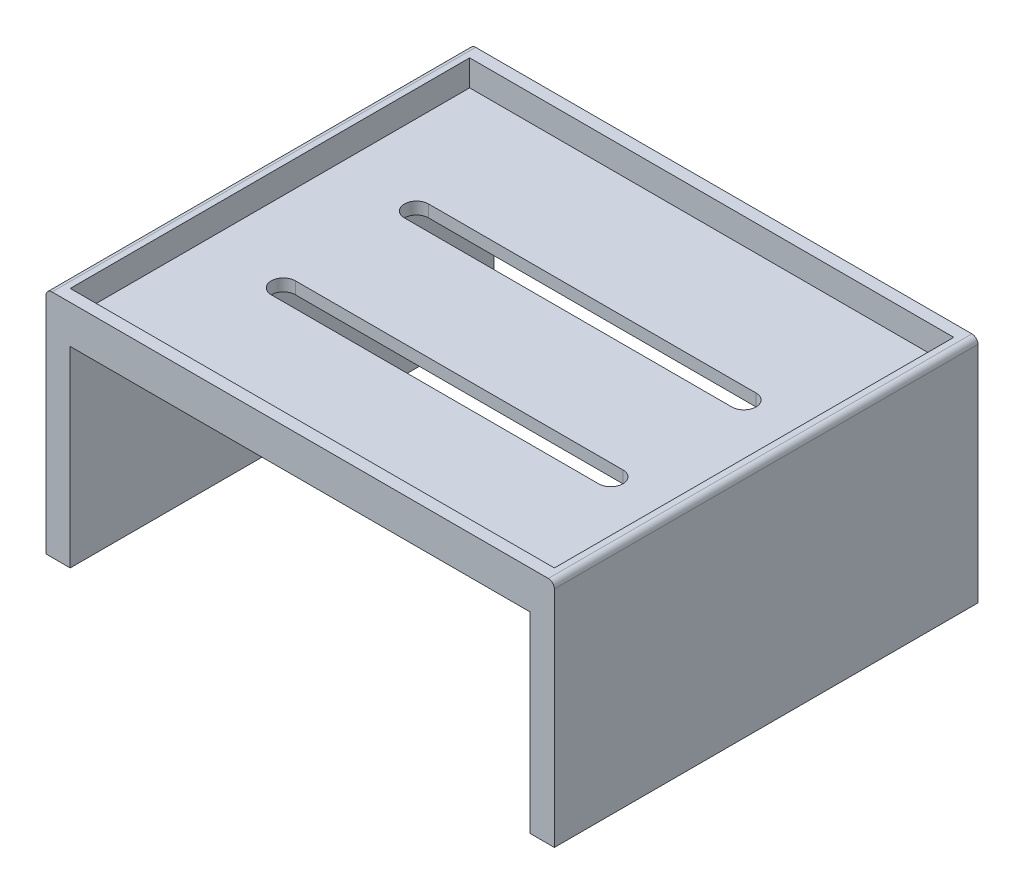
ISO-10303-21;
HEADER;
FILE_DESCRIPTION(('STEP AP214'),'2;1');
FILE_NAME('part.step','',(''),(''),'','','');
FILE_SCHEMA(('AUTOMOTIVE_DESIGN { 1 0 10303 214 1 1 1 1 }'));
ENDSEC;
DATA;
#1=APPLICATION_CONTEXT('core data for automotive mechanical design processes');
#2=APPLICATION_PROTOCOL_DEFINITION('international standard','automotive_design',2000,#1);
#3=PRODUCT_CONTEXT('',#1,'mechanical');
#4=PRODUCT('Part','Part','',(#3));
#5=PRODUCT_RELATED_PRODUCT_CATEGORY('part','',(#4));
#6=PRODUCT_DEFINITION_FORMATION('','',#4);
#7=PRODUCT_DEFINITION_CONTEXT('part definition',#1,'design');
#8=PRODUCT_DEFINITION('design','',#6,#7);
#9=PRODUCT_DEFINITION_SHAPE('','',#8);
#10=(LENGTH_UNIT() NAMED_UNIT(*) SI_UNIT(.MILLI.,.METRE.));
#11=(NAMED_UNIT(*) PLANE_ANGLE_UNIT() SI_UNIT($,.RADIAN.));
#12=(NAMED_UNIT(*) SI_UNIT($,.STERADIAN.) SOLID_ANGLE_UNIT());
#13=UNCERTAINTY_MEASURE_WITH_UNIT(LENGTH_MEASURE(1.E-05),#10,'distance_accuracy_value','');
#14=(GEOMETRIC_REPRESENTATION_CONTEXT(3) GLOBAL_UNCERTAINTY_ASSIGNED_CONTEXT((#13)) GLOBAL_UNIT_ASSIGNED_CONTEXT((#10,
#11,#12)) REPRESENTATION_CONTEXT('',''));
#15=CARTESIAN_POINT('',(0.,0.,0.));
#16=DIRECTION('',(0.,0.,1.));
#17=DIRECTION('',(1.,0.,0.));
#18=AXIS2_PLACEMENT_3D('',#15,#16,#17);
#19=CARTESIAN_POINT('',(-76.0997442455243,110.652173913043,-350.));
#20=DIRECTION('',(0.,1.,0.));
#21=DIRECTION('',(0.,0.,1.));
#22=AXIS2_PLACEMENT_3D('',#19,#20,#21);
#23=PLANE('',#22);
#24=DIRECTION('',(-1.,0.,0.));
#25=VECTOR('',#24,1.);
#26=CARTESIAN_POINT('',(-76.0997442455243,110.652173913043,-350.));
#27=LINE('',#26,#25);
#28=CARTESIAN_POINT('',(338.900255754476,110.652173913043,-350.));
#29=VERTEX_POINT('',#28);
#30=CARTESIAN_POINT('',(-71.0997442455243,110.652173913043,-350.));
#31=VERTEX_POINT('',#30);
#32=EDGE_CURVE('E307',#29,#31,#27,.T.);
#33=ORIENTED_EDGE('',*,*,#32,.T.);
#34=DIRECTION('',(0.,0.,1.));
#35=VECTOR('',#34,1.);
#36=CARTESIAN_POINT('',(-71.0997442455243,110.652173913043,-350.));
#37=LINE('',#36,#35);
#38=CARTESIAN_POINT('',(-71.0997442455243,110.652173913043,0.));
#39=VERTEX_POINT('',#38);
#40=EDGE_CURVE('E346',#31,#39,#37,.T.);
#41=ORIENTED_EDGE('',*,*,#40,.T.);
#42=DIRECTION('',(-1.,0.,0.));
#43=VECTOR('',#42,1.);
#44=CARTESIAN_POINT('',(-76.0997442455243,110.652173913043,0.));
#45=LINE('',#44,#43);
#46=CARTESIAN_POINT('',(338.900255754476,110.652173913043,0.));
#47=VERTEX_POINT('',#46);
#48=EDGE_CURVE('E289',#47,#39,#45,.T.);
#49=ORIENTED_EDGE('',*,*,#48,.F.);
#50=DIRECTION('',(0.,0.,1.));
#51=VECTOR('',#50,1.);
#52=CARTESIAN_POINT('',(338.900255754476,110.652173913043,-350.));
#53=LINE('',#52,#51);
#54=EDGE_CURVE('E334',#47,#29,#53,.F.);
#55=ORIENTED_EDGE('',*,*,#54,.T.);
#56=EDGE_LOOP('',(#33,#41,#49,#55));
#57=FACE_BOUND('',#56,.T.);
#58=DIRECTION('',(1.,0.,0.));
#59=VECTOR('',#58,1.);
#60=CARTESIAN_POINT('',(0.,110.652173913043,-340.));
#61=LINE('',#60,#59);
#62=CARTESIAN_POINT('',(-66.0997442455243,110.652173913043,-340.));
#63=VERTEX_POINT('',#62);
#64=CARTESIAN_POINT('',(333.900255754476,110.652173913043,-340.));
#65=VERTEX_POINT('',#64);
#66=EDGE_CURVE('E269',#63,#65,#61,.T.);
#67=ORIENTED_EDGE('',*,*,#66,.T.);
#68=DIRECTION('',(0.,0.,1.));
#69=VECTOR('',#68,1.);
#70=CARTESIAN_POINT('',(333.900255754476,110.652173913043,-1.68501705394022E-13));
#71=LINE('',#70,#69);
#72=CARTESIAN_POINT('',(333.900255754476,110.652173913043,-9.99999999999995));
#73=VERTEX_POINT('',#72);
#74=EDGE_CURVE('E222',#65,#73,#71,.T.);
#75=ORIENTED_EDGE('',*,*,#74,.T.);
#76=DIRECTION('',(1.,0.,0.));
#77=VECTOR('',#76,1.);
#78=CARTESIAN_POINT('',(0.,110.652173913043,-9.99999999999997));
#79=LINE('',#78,#77);
#80=CARTESIAN_POINT('',(-66.0997442455243,110.652173913043,-9.99999999999997));
#81=VERTEX_POINT('',#80);
#82=EDGE_CURVE('E258',#81,#73,#79,.T.);
#83=ORIENTED_EDGE('',*,*,#82,.F.);
#84=DIRECTION('',(0.,0.,1.));
#85=VECTOR('',#84,1.);
#86=CARTESIAN_POINT('',(-66.0997442455243,110.652173913043,0.));
#87=LINE('',#86,#85);
#88=EDGE_CURVE('E272',#63,#81,#87,.T.);
#89=ORIENTED_EDGE('',*,*,#88,.F.);
#90=EDGE_LOOP('',(#67,#75,#83,#89));
#91=FACE_BOUND('',#90,.T.);
#92=ADVANCED_FACE('F35',(#57,#91),#23,.T.);
#93=CARTESIAN_POINT('',(-76.0997442455243,110.652173913043,-350.));
#94=DIRECTION('',(-1.,0.,0.));
#95=DIRECTION('',(0.,-1.,0.));
#96=AXIS2_PLACEMENT_3D('',#93,#94,#95);
#97=PLANE('',#96);
#98=DIRECTION('',(0.,-1.,0.));
#99=VECTOR('',#98,1.);
#100=CARTESIAN_POINT('',(-76.0997442455243,110.652173913043,0.));
#101=LINE('',#100,#99);
#102=CARTESIAN_POINT('',(-76.0997442455243,105.652173913043,0.));
#103=VERTEX_POINT('',#102);
#104=CARTESIAN_POINT('',(-76.0997442455243,-79.3478260869565,0.));
#105=VERTEX_POINT('',#104);
#106=EDGE_CURVE('E279',#103,#105,#101,.T.);
#107=ORIENTED_EDGE('',*,*,#106,.F.);
#108=DIRECTION('',(0.,0.,1.));
#109=VECTOR('',#108,1.);
#110=CARTESIAN_POINT('',(-76.0997442455243,105.652173913043,-350.));
#111=LINE('',#110,#109);
#112=CARTESIAN_POINT('',(-76.0997442455243,105.652173913043,-350.));
#113=VERTEX_POINT('',#112);
#114=EDGE_CURVE('E353',#103,#113,#111,.F.);
#115=ORIENTED_EDGE('',*,*,#114,.T.);
#116=DIRECTION('',(0.,-1.,0.));
#117=VECTOR('',#116,1.);
#118=CARTESIAN_POINT('',(-76.0997442455243,110.652173913043,-350.));
#119=LINE('',#118,#117);
#120=CARTESIAN_POINT('',(-76.0997442455243,-79.3478260869565,-350.));
#121=VERTEX_POINT('',#120);
#122=EDGE_CURVE('E286',#113,#121,#119,.T.);
#123=ORIENTED_EDGE('',*,*,#122,.T.);
#124=DIRECTION('',(0.,0.,1.));
#125=VECTOR('',#124,1.);
#126=CARTESIAN_POINT('',(-76.0997442455243,-79.3478260869565,-350.));
#127=LINE('',#126,#125);
#128=EDGE_CURVE('E310',#121,#105,#127,.T.);
#129=ORIENTED_EDGE('',*,*,#128,.T.);
#130=EDGE_LOOP('',(#107,#115,#123,#129));
#131=FACE_BOUND('',#130,.T.);
#132=ADVANCED_FACE('F375',(#131),#97,.T.);
#133=CARTESIAN_POINT('',(343.900255754476,110.652173913043,-350.));
#134=DIRECTION('',(1.,0.,0.));
#135=DIRECTION('',(0.,1.,0.));
#136=AXIS2_PLACEMENT_3D('',#133,#134,#135);
#137=PLANE('',#136);
#138=DIRECTION('',(0.,1.,0.));
#139=VECTOR('',#138,1.);
#140=CARTESIAN_POINT('',(343.900255754476,110.652173913043,-350.));
#141=LINE('',#140,#139);
#142=CARTESIAN_POINT('',(343.900255754476,-79.3478260869565,-350.));
#143=VERTEX_POINT('',#142);
#144=CARTESIAN_POINT('',(343.900255754476,105.652173913043,-350.));
#145=VERTEX_POINT('',#144);
#146=EDGE_CURVE('E304',#143,#145,#141,.T.);
#147=ORIENTED_EDGE('',*,*,#146,.T.);
#148=DIRECTION('',(0.,0.,1.));
#149=VECTOR('',#148,1.);
#150=CARTESIAN_POINT('',(343.900255754476,105.652173913043,-350.));
#151=LINE('',#150,#149);
#152=CARTESIAN_POINT('',(343.900255754476,105.652173913043,0.));
#153=VERTEX_POINT('',#152);
#154=EDGE_CURVE('E11',#145,#153,#151,.T.);
#155=ORIENTED_EDGE('',*,*,#154,.T.);
#156=DIRECTION('',(0.,1.,0.));
#157=VECTOR('',#156,1.);
#158=CARTESIAN_POINT('',(343.900255754476,110.652173913043,0.));
#159=LINE('',#158,#157);
#160=CARTESIAN_POINT('',(343.900255754476,-79.3478260869565,0.));
#161=VERTEX_POINT('',#160);
#162=EDGE_CURVE('E327',#161,#153,#159,.T.);
#163=ORIENTED_EDGE('',*,*,#162,.F.);
#164=DIRECTION('',(0.,0.,1.));
#165=VECTOR('',#164,1.);
#166=CARTESIAN_POINT('',(343.900255754476,-79.3478260869565,-350.));
#167=LINE('',#166,#165);
#168=EDGE_CURVE('E332',#143,#161,#167,.T.);
#169=ORIENTED_EDGE('',*,*,#168,.F.);
#170=EDGE_LOOP('',(#147,#155,#163,#169));
#171=FACE_BOUND('',#170,.T.);
#172=ADVANCED_FACE('F398',(#171),#137,.T.);
#173=CARTESIAN_POINT('',(343.900255754476,-79.3478260869565,-350.));
#174=DIRECTION('',(0.,-1.,0.));
#175=DIRECTION('',(0.,0.,-1.));
#176=AXIS2_PLACEMENT_3D('',#173,#174,#175);
#177=PLANE('',#176);
#178=DIRECTION('',(1.,0.,0.));
#179=VECTOR('',#178,1.);
#180=CARTESIAN_POINT('',(343.900255754476,-79.3478260869565,0.));
#181=LINE('',#180,#179);
#182=CARTESIAN_POINT('',(323.900255754476,-79.3478260869565,0.));
#183=VERTEX_POINT('',#182);
#184=EDGE_CURVE('E324',#183,#161,#181,.T.);
#185=ORIENTED_EDGE('',*,*,#184,.F.);
#186=DIRECTION('',(0.,0.,1.));
#187=VECTOR('',#186,1.);
#188=CARTESIAN_POINT('',(323.900255754476,-79.3478260869565,-350.));
#189=LINE('',#188,#187);
#190=CARTESIAN_POINT('',(323.900255754476,-79.3478260869565,-350.));
#191=VERTEX_POINT('',#190);
#192=EDGE_CURVE('E335',#191,#183,#189,.T.);
#193=ORIENTED_EDGE('',*,*,#192,.F.);
#194=DIRECTION('',(1.,0.,0.));
#195=VECTOR('',#194,1.);
#196=CARTESIAN_POINT('',(343.900255754476,-79.3478260869565,-350.));
#197=LINE('',#196,#195);
#198=EDGE_CURVE('E301',#191,#143,#197,.T.);
#199=ORIENTED_EDGE('',*,*,#198,.T.);
#200=ORIENTED_EDGE('',*,*,#168,.T.);
#201=EDGE_LOOP('',(#185,#193,#199,#200));
#202=FACE_BOUND('',#201,.T.);
#203=ADVANCED_FACE('F394',(#202),#177,.T.);
#204=CARTESIAN_POINT('',(323.900255754476,-79.3478260869565,-350.));
#205=DIRECTION('',(-1.,0.,0.));
#206=DIRECTION('',(0.,-1.,0.));
#207=AXIS2_PLACEMENT_3D('',#204,#205,#206);
#208=PLANE('',#207);
#209=DIRECTION('',(0.,-1.,0.));
#210=VECTOR('',#209,1.);
#211=CARTESIAN_POINT('',(323.900255754476,-79.3478260869565,0.));
#212=LINE('',#211,#210);
#213=CARTESIAN_POINT('',(323.900255754476,79.1521739130436,0.));
#214=VERTEX_POINT('',#213);
#215=EDGE_CURVE('E321',#214,#183,#212,.T.);
#216=ORIENTED_EDGE('',*,*,#215,.F.);
#217=DIRECTION('',(0.,0.,1.));
#218=VECTOR('',#217,1.);
#219=CARTESIAN_POINT('',(323.900255754476,79.1521739130436,-350.));
#220=LINE('',#219,#218);
#221=CARTESIAN_POINT('',(323.900255754476,79.1521739130436,-350.));
#222=VERTEX_POINT('',#221);
#223=EDGE_CURVE('E337',#222,#214,#220,.T.);
#224=ORIENTED_EDGE('',*,*,#223,.F.);
#225=DIRECTION('',(0.,-1.,0.));
#226=VECTOR('',#225,1.);
#227=CARTESIAN_POINT('',(323.900255754476,-79.3478260869565,-350.));
#228=LINE('',#227,#226);
#229=EDGE_CURVE('E298',#222,#191,#228,.T.);
#230=ORIENTED_EDGE('',*,*,#229,.T.);
#231=ORIENTED_EDGE('',*,*,#192,.T.);
#232=EDGE_LOOP('',(#216,#224,#230,#231));
#233=FACE_BOUND('',#232,.T.);
#234=ADVANCED_FACE('F390',(#233),#208,.T.);
#235=CARTESIAN_POINT('',(323.900255754476,79.1521739130436,-350.));
#236=DIRECTION('',(0.,-1.,0.));
#237=DIRECTION('',(1.,0.,0.));
#238=AXIS2_PLACEMENT_3D('',#235,#236,#237);
#239=PLANE('',#238);
#240=CARTESIAN_POINT('',(0.,79.1521739130435,-230.));
#241=DIRECTION('',(0.,1.,0.));
#242=DIRECTION('',(0.,0.,1.));
#243=AXIS2_PLACEMENT_3D('',#240,#241,#242);
#244=CIRCLE('',#243,10.);
#245=CARTESIAN_POINT('',(0.,79.1521739130435,-240.));
#246=VERTEX_POINT('',#245);
#247=CARTESIAN_POINT('',(0.,79.1521739130435,-220.));
#248=VERTEX_POINT('',#247);
#249=EDGE_CURVE('E188',#246,#248,#244,.T.);
#250=ORIENTED_EDGE('',*,*,#249,.T.);
#251=DIRECTION('',(1.,0.,0.));
#252=VECTOR('',#251,1.);
#253=CARTESIAN_POINT('',(0.,79.1521739130435,-220.));
#254=LINE('',#253,#252);
#255=CARTESIAN_POINT('',(270.518831374512,79.1521739130435,-220.));
#256=VERTEX_POINT('',#255);
#257=EDGE_CURVE('E199',#248,#256,#254,.T.);
#258=ORIENTED_EDGE('',*,*,#257,.T.);
#259=CARTESIAN_POINT('',(270.518831374512,79.1521739130435,-230.));
#260=DIRECTION('',(0.,1.,0.));
#261=DIRECTION('',(0.,0.,1.));
#262=AXIS2_PLACEMENT_3D('',#259,#260,#261);
#263=CIRCLE('',#262,10.);
#264=CARTESIAN_POINT('',(270.518831374512,79.1521739130435,-240.));
#265=VERTEX_POINT('',#264);
#266=EDGE_CURVE('E50',#256,#265,#263,.T.);
#267=ORIENTED_EDGE('',*,*,#266,.T.);
#268=DIRECTION('',(-1.,0.,0.));
#269=VECTOR('',#268,1.);
#270=CARTESIAN_POINT('',(0.,79.1521739130435,-240.));
#271=LINE('',#270,#269);
#272=EDGE_CURVE('E196',#265,#246,#271,.T.);
#273=ORIENTED_EDGE('',*,*,#272,.T.);
#274=EDGE_LOOP('',(#250,#258,#267,#273));
#275=FACE_BOUND('',#274,.T.);
#276=CARTESIAN_POINT('',(270.518831374512,79.1521739130435,-120.));
#277=DIRECTION('',(0.,1.,0.));
#278=DIRECTION('',(0.,0.,1.));
#279=AXIS2_PLACEMENT_3D('',#276,#277,#278);
#280=CIRCLE('',#279,9.99999999999999);
#281=CARTESIAN_POINT('',(270.518831374512,79.1521739130435,-110.));
#282=VERTEX_POINT('',#281);
#283=CARTESIAN_POINT('',(270.518831374512,79.1521739130435,-130.));
#284=VERTEX_POINT('',#283);
#285=EDGE_CURVE('E226',#282,#284,#280,.T.);
#286=ORIENTED_EDGE('',*,*,#285,.T.);
#287=DIRECTION('',(-1.,0.,0.));
#288=VECTOR('',#287,1.);
#289=CARTESIAN_POINT('',(270.518831374512,79.1521739130435,-130.));
#290=LINE('',#289,#288);
#291=CARTESIAN_POINT('',(0.,79.1521739130435,-130.));
#292=VERTEX_POINT('',#291);
#293=EDGE_CURVE('E229',#284,#292,#290,.T.);
#294=ORIENTED_EDGE('',*,*,#293,.T.);
#295=CARTESIAN_POINT('',(0.,79.1521739130435,-120.));
#296=DIRECTION('',(0.,1.,0.));
#297=DIRECTION('',(0.,0.,1.));
#298=AXIS2_PLACEMENT_3D('',#295,#296,#297);
#299=CIRCLE('',#298,9.99999999999999);
#300=CARTESIAN_POINT('',(0.,79.1521739130435,-110.));
#301=VERTEX_POINT('',#300);
#302=EDGE_CURVE('E58',#292,#301,#299,.T.);
#303=ORIENTED_EDGE('',*,*,#302,.T.);
#304=DIRECTION('',(1.,0.,0.));
#305=VECTOR('',#304,1.);
#306=CARTESIAN_POINT('',(270.518831374512,79.1521739130435,-110.));
#307=LINE('',#306,#305);
#308=EDGE_CURVE('E234',#301,#282,#307,.T.);
#309=ORIENTED_EDGE('',*,*,#308,.T.);
#310=EDGE_LOOP('',(#286,#294,#303,#309));
#311=FACE_BOUND('',#310,.T.);
#312=DIRECTION('',(1.,0.,0.));
#313=VECTOR('',#312,1.);
#314=CARTESIAN_POINT('',(323.900255754476,79.1521739130436,0.));
#315=LINE('',#314,#313);
#316=CARTESIAN_POINT('',(-56.0997442455243,79.1521739130435,0.));
#317=VERTEX_POINT('',#316);
#318=EDGE_CURVE('E318',#317,#214,#315,.T.);
#319=ORIENTED_EDGE('',*,*,#318,.F.);
#320=DIRECTION('',(0.,0.,1.));
#321=VECTOR('',#320,1.);
#322=CARTESIAN_POINT('',(-56.0997442455243,79.1521739130435,-350.));
#323=LINE('',#322,#321);
#324=CARTESIAN_POINT('',(-56.0997442455243,79.1521739130435,-350.));
#325=VERTEX_POINT('',#324);
#326=EDGE_CURVE('E339',#325,#317,#323,.T.);
#327=ORIENTED_EDGE('',*,*,#326,.F.);
#328=DIRECTION('',(1.,0.,0.));
#329=VECTOR('',#328,1.);
#330=CARTESIAN_POINT('',(323.900255754476,79.1521739130436,-350.));
#331=LINE('',#330,#329);
#332=EDGE_CURVE('E295',#325,#222,#331,.T.);
#333=ORIENTED_EDGE('',*,*,#332,.T.);
#334=ORIENTED_EDGE('',*,*,#223,.T.);
#335=EDGE_LOOP('',(#319,#327,#333,#334));
#336=FACE_BOUND('',#335,.T.);
#337=ADVANCED_FACE('F203',(#275,#311,#336),#239,.T.);
#338=CARTESIAN_POINT('',(-56.0997442455243,-79.3478260869565,-350.));
#339=DIRECTION('',(1.,0.,0.));
#340=DIRECTION('',(0.,0.,-1.));
#341=AXIS2_PLACEMENT_3D('',#338,#339,#340);
#342=PLANE('',#341);
#343=DIRECTION('',(0.,1.,0.));
#344=VECTOR('',#343,1.);
#345=CARTESIAN_POINT('',(-56.0997442455243,-79.3478260869565,0.));
#346=LINE('',#345,#344);
#347=CARTESIAN_POINT('',(-56.0997442455243,-79.3478260869565,0.));
#348=VERTEX_POINT('',#347);
#349=EDGE_CURVE('E315',#348,#317,#346,.T.);
#350=ORIENTED_EDGE('',*,*,#349,.F.);
#351=DIRECTION('',(0.,0.,1.));
#352=VECTOR('',#351,1.);
#353=CARTESIAN_POINT('',(-56.0997442455243,-79.3478260869565,-350.));
#354=LINE('',#353,#352);
#355=CARTESIAN_POINT('',(-56.0997442455243,-79.3478260869565,-350.));
#356=VERTEX_POINT('',#355);
#357=EDGE_CURVE('E341',#356,#348,#354,.T.);
#358=ORIENTED_EDGE('',*,*,#357,.F.);
#359=DIRECTION('',(0.,1.,0.));
#360=VECTOR('',#359,1.);
#361=CARTESIAN_POINT('',(-56.0997442455243,-79.3478260869565,-350.));
#362=LINE('',#361,#360);
#363=EDGE_CURVE('E292',#356,#325,#362,.T.);
#364=ORIENTED_EDGE('',*,*,#363,.T.);
#365=ORIENTED_EDGE('',*,*,#326,.T.);
#366=EDGE_LOOP('',(#350,#358,#364,#365));
#367=FACE_BOUND('',#366,.T.);
#368=ADVANCED_FACE('F383',(#367),#342,.T.);
#369=CARTESIAN_POINT('',(-76.0997442455243,-79.3478260869565,-350.));
#370=DIRECTION('',(0.,-1.,0.));
#371=DIRECTION('',(0.,0.,-1.));
#372=AXIS2_PLACEMENT_3D('',#369,#370,#371);
#373=PLANE('',#372);
#374=DIRECTION('',(1.,0.,0.));
#375=VECTOR('',#374,1.);
#376=CARTESIAN_POINT('',(-76.0997442455243,-79.3478260869565,0.));
#377=LINE('',#376,#375);
#378=EDGE_CURVE('E312',#105,#348,#377,.T.);
#379=ORIENTED_EDGE('',*,*,#378,.F.);
#380=ORIENTED_EDGE('',*,*,#128,.F.);
#381=DIRECTION('',(1.,0.,0.));
#382=VECTOR('',#381,1.);
#383=CARTESIAN_POINT('',(-76.0997442455243,-79.3478260869565,-350.));
#384=LINE('',#383,#382);
#385=EDGE_CURVE('E288',#121,#356,#384,.T.);
#386=ORIENTED_EDGE('',*,*,#385,.T.);
#387=ORIENTED_EDGE('',*,*,#357,.T.);
#388=EDGE_LOOP('',(#379,#380,#386,#387));
#389=FACE_BOUND('',#388,.T.);
#390=ADVANCED_FACE('F379',(#389),#373,.T.);
#391=CARTESIAN_POINT('',(0.,0.,-350.));
#392=DIRECTION('',(0.,0.,1.));
#393=DIRECTION('',(1.,0.,0.));
#394=AXIS2_PLACEMENT_3D('',#391,#392,#393);
#395=PLANE('',#394);
#396=ORIENTED_EDGE('',*,*,#122,.F.);
#397=CARTESIAN_POINT('',(-71.0997442455243,105.652173913043,-350.));
#398=DIRECTION('',(0.,0.,1.));
#399=DIRECTION('',(1.,0.,0.));
#400=AXIS2_PLACEMENT_3D('',#397,#398,#399);
#401=CIRCLE('',#400,5.);
#402=EDGE_CURVE('E43',#113,#31,#401,.F.);
#403=ORIENTED_EDGE('',*,*,#402,.T.);
#404=ORIENTED_EDGE('',*,*,#32,.F.);
#405=CARTESIAN_POINT('',(338.900255754476,105.652173913043,-350.));
#406=DIRECTION('',(0.,0.,1.));
#407=DIRECTION('',(1.,0.,0.));
#408=AXIS2_PLACEMENT_3D('',#405,#406,#407);
#409=CIRCLE('',#408,5.);
#410=EDGE_CURVE('E355',#29,#145,#409,.F.);
#411=ORIENTED_EDGE('',*,*,#410,.T.);
#412=ORIENTED_EDGE('',*,*,#146,.F.);
#413=ORIENTED_EDGE('',*,*,#198,.F.);
#414=ORIENTED_EDGE('',*,*,#229,.F.);
#415=ORIENTED_EDGE('',*,*,#332,.F.);
#416=ORIENTED_EDGE('',*,*,#363,.F.);
#417=ORIENTED_EDGE('',*,*,#385,.F.);
#418=EDGE_LOOP('',(#396,#403,#404,#411,#412,#413,#414,#415,#416,#417));
#419=FACE_BOUND('',#418,.T.);
#420=ADVANCED_FACE('F360',(#419),#395,.F.);
#421=CARTESIAN_POINT('',(0.,0.,0.));
#422=DIRECTION('',(0.,0.,1.));
#423=DIRECTION('',(1.,0.,0.));
#424=AXIS2_PLACEMENT_3D('',#421,#422,#423);
#425=PLANE('',#424);
#426=ORIENTED_EDGE('',*,*,#48,.T.);
#427=CARTESIAN_POINT('',(-71.0997442455243,105.652173913043,0.));
#428=DIRECTION('',(0.,0.,1.));
#429=DIRECTION('',(1.,0.,0.));
#430=AXIS2_PLACEMENT_3D('',#427,#428,#429);
#431=CIRCLE('',#430,5.);
#432=EDGE_CURVE('E351',#39,#103,#431,.T.);
#433=ORIENTED_EDGE('',*,*,#432,.T.);
#434=ORIENTED_EDGE('',*,*,#106,.T.);
#435=ORIENTED_EDGE('',*,*,#378,.T.);
#436=ORIENTED_EDGE('',*,*,#349,.T.);
#437=ORIENTED_EDGE('',*,*,#318,.T.);
#438=ORIENTED_EDGE('',*,*,#215,.T.);
#439=ORIENTED_EDGE('',*,*,#184,.T.);
#440=ORIENTED_EDGE('',*,*,#162,.T.);
#441=CARTESIAN_POINT('',(338.900255754476,105.652173913043,0.));
#442=DIRECTION('',(0.,0.,1.));
#443=DIRECTION('',(1.,0.,0.));
#444=AXIS2_PLACEMENT_3D('',#441,#442,#443);
#445=CIRCLE('',#444,5.);
#446=EDGE_CURVE('E349',#153,#47,#445,.T.);
#447=ORIENTED_EDGE('',*,*,#446,.T.);
#448=EDGE_LOOP('',(#426,#433,#434,#435,#436,#437,#438,#439,#440,#447));
#449=FACE_BOUND('',#448,.T.);
#450=ADVANCED_FACE('F373',(#449),#425,.T.);
#451=CARTESIAN_POINT('',(333.900255754476,89.1521739130435,-1.68501705394022E-13));
#452=DIRECTION('',(-1.,0.,0.));
#453=DIRECTION('',(0.,0.,1.));
#454=AXIS2_PLACEMENT_3D('',#451,#452,#453);
#455=PLANE('',#454);
#456=ORIENTED_EDGE('',*,*,#74,.F.);
#457=DIRECTION('',(0.,1.,0.));
#458=VECTOR('',#457,1.);
#459=CARTESIAN_POINT('',(333.900255754476,89.1521739130435,-340.));
#460=LINE('',#459,#458);
#461=CARTESIAN_POINT('',(333.900255754476,89.1521739130435,-340.));
#462=VERTEX_POINT('',#461);
#463=EDGE_CURVE('E266',#462,#65,#460,.T.);
#464=ORIENTED_EDGE('',*,*,#463,.F.);
#465=DIRECTION('',(0.,0.,1.));
#466=VECTOR('',#465,1.);
#467=CARTESIAN_POINT('',(333.900255754476,89.1521739130435,-1.68501705394022E-13));
#468=LINE('',#467,#466);
#469=CARTESIAN_POINT('',(333.900255754476,89.1521739130435,-9.99999999999995));
#470=VERTEX_POINT('',#469);
#471=EDGE_CURVE('E255',#462,#470,#468,.T.);
#472=ORIENTED_EDGE('',*,*,#471,.T.);
#473=DIRECTION('',(0.,1.,0.));
#474=VECTOR('',#473,1.);
#475=CARTESIAN_POINT('',(333.900255754476,89.1521739130435,-9.99999999999995));
#476=LINE('',#475,#474);
#477=EDGE_CURVE('E277',#470,#73,#476,.T.);
#478=ORIENTED_EDGE('',*,*,#477,.T.);
#479=EDGE_LOOP('',(#456,#464,#472,#478));
#480=FACE_BOUND('',#479,.T.);
#481=ADVANCED_FACE('F437',(#480),#455,.T.);
#482=CARTESIAN_POINT('',(0.,89.1521739130435,-9.99999999999997));
#483=DIRECTION('',(0.,0.,1.));
#484=DIRECTION('',(1.,0.,0.));
#485=AXIS2_PLACEMENT_3D('',#482,#483,#484);
#486=PLANE('',#485);
#487=ORIENTED_EDGE('',*,*,#82,.T.);
#488=ORIENTED_EDGE('',*,*,#477,.F.);
#489=DIRECTION('',(1.,0.,0.));
#490=VECTOR('',#489,1.);
#491=CARTESIAN_POINT('',(0.,89.1521739130435,-9.99999999999997));
#492=LINE('',#491,#490);
#493=CARTESIAN_POINT('',(-66.0997442455243,89.1521739130435,-9.99999999999997));
#494=VERTEX_POINT('',#493);
#495=EDGE_CURVE('E263',#494,#470,#492,.T.);
#496=ORIENTED_EDGE('',*,*,#495,.F.);
#497=DIRECTION('',(0.,1.,0.));
#498=VECTOR('',#497,1.);
#499=CARTESIAN_POINT('',(-66.0997442455243,89.1521739130435,-9.99999999999997));
#500=LINE('',#499,#498);
#501=EDGE_CURVE('E280',#494,#81,#500,.T.);
#502=ORIENTED_EDGE('',*,*,#501,.T.);
#503=EDGE_LOOP('',(#487,#488,#496,#502));
#504=FACE_BOUND('',#503,.T.);
#505=ADVANCED_FACE('F441',(#504),#486,.F.);
#506=CARTESIAN_POINT('',(-66.0997442455243,89.1521739130435,0.));
#507=DIRECTION('',(-1.,0.,0.));
#508=DIRECTION('',(0.,0.,1.));
#509=AXIS2_PLACEMENT_3D('',#506,#507,#508);
#510=PLANE('',#509);
#511=ORIENTED_EDGE('',*,*,#88,.T.);
#512=ORIENTED_EDGE('',*,*,#501,.F.);
#513=DIRECTION('',(0.,0.,1.));
#514=VECTOR('',#513,1.);
#515=CARTESIAN_POINT('',(-66.0997442455243,89.1521739130435,0.));
#516=LINE('',#515,#514);
#517=CARTESIAN_POINT('',(-66.0997442455243,89.1521739130435,-340.));
#518=VERTEX_POINT('',#517);
#519=EDGE_CURVE('E260',#518,#494,#516,.T.);
#520=ORIENTED_EDGE('',*,*,#519,.F.);
#521=DIRECTION('',(0.,1.,0.));
#522=VECTOR('',#521,1.);
#523=CARTESIAN_POINT('',(-66.0997442455243,89.1521739130435,-340.));
#524=LINE('',#523,#522);
#525=EDGE_CURVE('E282',#518,#63,#524,.T.);
#526=ORIENTED_EDGE('',*,*,#525,.T.);
#527=EDGE_LOOP('',(#511,#512,#520,#526));
#528=FACE_BOUND('',#527,.T.);
#529=ADVANCED_FACE('F446',(#528),#510,.F.);
#530=CARTESIAN_POINT('',(0.,89.1521739130435,-340.));
#531=DIRECTION('',(0.,0.,1.));
#532=DIRECTION('',(1.,0.,0.));
#533=AXIS2_PLACEMENT_3D('',#530,#531,#532);
#534=PLANE('',#533);
#535=ORIENTED_EDGE('',*,*,#66,.F.);
#536=ORIENTED_EDGE('',*,*,#525,.F.);
#537=DIRECTION('',(1.,0.,0.));
#538=VECTOR('',#537,1.);
#539=CARTESIAN_POINT('',(0.,89.1521739130435,-340.));
#540=LINE('',#539,#538);
#541=EDGE_CURVE('E257',#518,#462,#540,.T.);
#542=ORIENTED_EDGE('',*,*,#541,.T.);
#543=ORIENTED_EDGE('',*,*,#463,.T.);
#544=EDGE_LOOP('',(#535,#536,#542,#543));
#545=FACE_BOUND('',#544,.T.);
#546=ADVANCED_FACE('F443',(#545),#534,.T.);
#547=CARTESIAN_POINT('',(0.,89.1521739130435,0.));
#548=DIRECTION('',(0.,1.,0.));
#549=DIRECTION('',(0.,0.,1.));
#550=AXIS2_PLACEMENT_3D('',#547,#548,#549);
#551=PLANE('',#550);
#552=CARTESIAN_POINT('',(0.,89.1521739130435,-230.));
#553=DIRECTION('',(0.,1.,0.));
#554=DIRECTION('',(0.,0.,1.));
#555=AXIS2_PLACEMENT_3D('',#552,#553,#554);
#556=CIRCLE('',#555,10.);
#557=CARTESIAN_POINT('',(0.,89.1521739130435,-240.));
#558=VERTEX_POINT('',#557);
#559=CARTESIAN_POINT('',(0.,89.1521739130435,-220.));
#560=VERTEX_POINT('',#559);
#561=EDGE_CURVE('E191',#558,#560,#556,.T.);
#562=ORIENTED_EDGE('',*,*,#561,.F.);
#563=DIRECTION('',(-1.,0.,0.));
#564=VECTOR('',#563,1.);
#565=CARTESIAN_POINT('',(0.,89.1521739130435,-240.));
#566=LINE('',#565,#564);
#567=CARTESIAN_POINT('',(270.518831374512,89.1521739130435,-240.));
#568=VERTEX_POINT('',#567);
#569=EDGE_CURVE('E206',#568,#558,#566,.T.);
#570=ORIENTED_EDGE('',*,*,#569,.F.);
#571=CARTESIAN_POINT('',(270.518831374512,89.1521739130435,-230.));
#572=DIRECTION('',(0.,1.,0.));
#573=DIRECTION('',(0.,0.,1.));
#574=AXIS2_PLACEMENT_3D('',#571,#572,#573);
#575=CIRCLE('',#574,10.);
#576=CARTESIAN_POINT('',(270.518831374512,89.1521739130435,-220.));
#577=VERTEX_POINT('',#576);
#578=EDGE_CURVE('E209',#577,#568,#575,.T.);
#579=ORIENTED_EDGE('',*,*,#578,.F.);
#580=DIRECTION('',(1.,0.,0.));
#581=VECTOR('',#580,1.);
#582=CARTESIAN_POINT('',(0.,89.1521739130435,-220.));
#583=LINE('',#582,#581);
#584=EDGE_CURVE('E215',#560,#577,#583,.T.);
#585=ORIENTED_EDGE('',*,*,#584,.F.);
#586=EDGE_LOOP('',(#562,#570,#579,#585));
#587=FACE_BOUND('',#586,.T.);
#588=CARTESIAN_POINT('',(270.518831374512,89.1521739130435,-120.));
#589=DIRECTION('',(0.,1.,0.));
#590=DIRECTION('',(0.,0.,1.));
#591=AXIS2_PLACEMENT_3D('',#588,#589,#590);
#592=CIRCLE('',#591,9.99999999999999);
#593=CARTESIAN_POINT('',(270.518831374512,89.1521739130435,-110.));
#594=VERTEX_POINT('',#593);
#595=CARTESIAN_POINT('',(270.518831374512,89.1521739130435,-130.));
#596=VERTEX_POINT('',#595);
#597=EDGE_CURVE('E238',#594,#596,#592,.T.);
#598=ORIENTED_EDGE('',*,*,#597,.F.);
#599=DIRECTION('',(1.,0.,0.));
#600=VECTOR('',#599,1.);
#601=CARTESIAN_POINT('',(270.518831374512,89.1521739130435,-110.));
#602=LINE('',#601,#600);
#603=CARTESIAN_POINT('',(0.,89.1521739130435,-110.));
#604=VERTEX_POINT('',#603);
#605=EDGE_CURVE('E230',#604,#594,#602,.T.);
#606=ORIENTED_EDGE('',*,*,#605,.F.);
#607=CARTESIAN_POINT('',(0.,89.1521739130435,-120.));
#608=DIRECTION('',(0.,1.,0.));
#609=DIRECTION('',(0.,0.,1.));
#610=AXIS2_PLACEMENT_3D('',#607,#608,#609);
#611=CIRCLE('',#610,9.99999999999999);
#612=CARTESIAN_POINT('',(0.,89.1521739130435,-130.));
#613=VERTEX_POINT('',#612);
#614=EDGE_CURVE('E243',#613,#604,#611,.T.);
#615=ORIENTED_EDGE('',*,*,#614,.F.);
#616=DIRECTION('',(-1.,0.,0.));
#617=VECTOR('',#616,1.);
#618=CARTESIAN_POINT('',(270.518831374512,89.1521739130435,-130.));
#619=LINE('',#618,#617);
#620=EDGE_CURVE('E240',#596,#613,#619,.T.);
#621=ORIENTED_EDGE('',*,*,#620,.F.);
#622=EDGE_LOOP('',(#598,#606,#615,#621));
#623=FACE_BOUND('',#622,.T.);
#624=ORIENTED_EDGE('',*,*,#471,.F.);
#625=ORIENTED_EDGE('',*,*,#541,.F.);
#626=ORIENTED_EDGE('',*,*,#519,.T.);
#627=ORIENTED_EDGE('',*,*,#495,.T.);
#628=EDGE_LOOP('',(#624,#625,#626,#627));
#629=FACE_BOUND('',#628,.T.);
#630=ADVANCED_FACE('F410',(#587,#623,#629),#551,.T.);
#631=CARTESIAN_POINT('',(-71.0997442455243,105.652173913043,-350.));
#632=DIRECTION('',(0.,0.,1.));
#633=DIRECTION('',(1.,0.,0.));
#634=AXIS2_PLACEMENT_3D('',#631,#632,#633);
#635=CYLINDRICAL_SURFACE('',#634,5.);
#636=ORIENTED_EDGE('',*,*,#402,.F.);
#637=ORIENTED_EDGE('',*,*,#114,.F.);
#638=ORIENTED_EDGE('',*,*,#432,.F.);
#639=ORIENTED_EDGE('',*,*,#40,.F.);
#640=EDGE_LOOP('',(#636,#637,#638,#639));
#641=FACE_BOUND('',#640,.T.);
#642=ADVANCED_FACE('F370',(#641),#635,.T.);
#643=CARTESIAN_POINT('',(338.900255754476,105.652173913043,-350.));
#644=DIRECTION('',(0.,0.,1.));
#645=DIRECTION('',(1.,0.,0.));
#646=AXIS2_PLACEMENT_3D('',#643,#644,#645);
#647=CYLINDRICAL_SURFACE('',#646,5.);
#648=ORIENTED_EDGE('',*,*,#410,.F.);
#649=ORIENTED_EDGE('',*,*,#54,.F.);
#650=ORIENTED_EDGE('',*,*,#446,.F.);
#651=ORIENTED_EDGE('',*,*,#154,.F.);
#652=EDGE_LOOP('',(#648,#649,#650,#651));
#653=FACE_BOUND('',#652,.T.);
#654=ADVANCED_FACE('F37',(#653),#647,.T.);
#655=CARTESIAN_POINT('',(270.518831374512,79.1521739130435,-120.));
#656=DIRECTION('',(0.,1.,0.));
#657=DIRECTION('',(0.,0.,1.));
#658=AXIS2_PLACEMENT_3D('',#655,#656,#657);
#659=CYLINDRICAL_SURFACE('',#658,9.99999999999999);
#660=ORIENTED_EDGE('',*,*,#597,.T.);
#661=DIRECTION('',(0.,1.,0.));
#662=VECTOR('',#661,1.);
#663=CARTESIAN_POINT('',(270.518831374512,79.1521739130435,-130.));
#664=LINE('',#663,#662);
#665=EDGE_CURVE('E237',#284,#596,#664,.T.);
#666=ORIENTED_EDGE('',*,*,#665,.F.);
#667=ORIENTED_EDGE('',*,*,#285,.F.);
#668=DIRECTION('',(0.,1.,0.));
#669=VECTOR('',#668,1.);
#670=CARTESIAN_POINT('',(270.518831374512,79.1521739130435,-110.));
#671=LINE('',#670,#669);
#672=EDGE_CURVE('E216',#282,#594,#671,.T.);
#673=ORIENTED_EDGE('',*,*,#672,.T.);
#674=EDGE_LOOP('',(#660,#666,#667,#673));
#675=FACE_BOUND('',#674,.T.);
#676=ADVANCED_FACE('F402',(#675),#659,.F.);
#677=CARTESIAN_POINT('',(270.518831374512,79.1521739130435,-110.));
#678=DIRECTION('',(0.,0.,1.));
#679=DIRECTION('',(1.,0.,0.));
#680=AXIS2_PLACEMENT_3D('',#677,#678,#679);
#681=PLANE('',#680);
#682=ORIENTED_EDGE('',*,*,#605,.T.);
#683=ORIENTED_EDGE('',*,*,#672,.F.);
#684=ORIENTED_EDGE('',*,*,#308,.F.);
#685=DIRECTION('',(0.,1.,0.));
#686=VECTOR('',#685,1.);
#687=CARTESIAN_POINT('',(0.,79.1521739130435,-110.));
#688=LINE('',#687,#686);
#689=EDGE_CURVE('E249',#301,#604,#688,.T.);
#690=ORIENTED_EDGE('',*,*,#689,.T.);
#691=EDGE_LOOP('',(#682,#683,#684,#690));
#692=FACE_BOUND('',#691,.T.);
#693=ADVANCED_FACE('F407',(#692),#681,.F.);
#694=CARTESIAN_POINT('',(0.,79.1521739130435,-120.));
#695=DIRECTION('',(0.,1.,0.));
#696=DIRECTION('',(0.,0.,1.));
#697=AXIS2_PLACEMENT_3D('',#694,#695,#696);
#698=CYLINDRICAL_SURFACE('',#697,9.99999999999999);
#699=ORIENTED_EDGE('',*,*,#614,.T.);
#700=ORIENTED_EDGE('',*,*,#689,.F.);
#701=ORIENTED_EDGE('',*,*,#302,.F.);
#702=DIRECTION('',(0.,1.,0.));
#703=VECTOR('',#702,1.);
#704=CARTESIAN_POINT('',(0.,79.1521739130435,-130.));
#705=LINE('',#704,#703);
#706=EDGE_CURVE('E251',#292,#613,#705,.T.);
#707=ORIENTED_EDGE('',*,*,#706,.T.);
#708=EDGE_LOOP('',(#699,#700,#701,#707));
#709=FACE_BOUND('',#708,.T.);
#710=ADVANCED_FACE('F460',(#709),#698,.F.);
#711=CARTESIAN_POINT('',(270.518831374512,79.1521739130435,-130.));
#712=DIRECTION('',(0.,0.,-1.));
#713=DIRECTION('',(-1.,0.,0.));
#714=AXIS2_PLACEMENT_3D('',#711,#712,#713);
#715=PLANE('',#714);
#716=ORIENTED_EDGE('',*,*,#620,.T.);
#717=ORIENTED_EDGE('',*,*,#706,.F.);
#718=ORIENTED_EDGE('',*,*,#293,.F.);
#719=ORIENTED_EDGE('',*,*,#665,.T.);
#720=EDGE_LOOP('',(#716,#717,#718,#719));
#721=FACE_BOUND('',#720,.T.);
#722=ADVANCED_FACE('F457',(#721),#715,.F.);
#723=CARTESIAN_POINT('',(0.,79.1521739130435,-230.));
#724=DIRECTION('',(0.,1.,0.));
#725=DIRECTION('',(0.,0.,1.));
#726=AXIS2_PLACEMENT_3D('',#723,#724,#725);
#727=CYLINDRICAL_SURFACE('',#726,10.);
#728=ORIENTED_EDGE('',*,*,#561,.T.);
#729=DIRECTION('',(0.,1.,0.));
#730=VECTOR('',#729,1.);
#731=CARTESIAN_POINT('',(0.,79.1521739130435,-220.));
#732=LINE('',#731,#730);
#733=EDGE_CURVE('E184',#248,#560,#732,.T.);
#734=ORIENTED_EDGE('',*,*,#733,.F.);
#735=ORIENTED_EDGE('',*,*,#249,.F.);
#736=DIRECTION('',(0.,1.,0.));
#737=VECTOR('',#736,1.);
#738=CARTESIAN_POINT('',(0.,79.1521739130435,-240.));
#739=LINE('',#738,#737);
#740=EDGE_CURVE('E220',#246,#558,#739,.T.);
#741=ORIENTED_EDGE('',*,*,#740,.T.);
#742=EDGE_LOOP('',(#728,#734,#735,#741));
#743=FACE_BOUND('',#742,.T.);
#744=ADVANCED_FACE('F186',(#743),#727,.F.);
#745=CARTESIAN_POINT('',(0.,79.1521739130435,-240.));
#746=DIRECTION('',(0.,0.,-1.));
#747=DIRECTION('',(-1.,0.,0.));
#748=AXIS2_PLACEMENT_3D('',#745,#746,#747);
#749=PLANE('',#748);
#750=ORIENTED_EDGE('',*,*,#569,.T.);
#751=ORIENTED_EDGE('',*,*,#740,.F.);
#752=ORIENTED_EDGE('',*,*,#272,.F.);
#753=DIRECTION('',(0.,1.,0.));
#754=VECTOR('',#753,1.);
#755=CARTESIAN_POINT('',(270.518831374512,79.1521739130435,-240.));
#756=LINE('',#755,#754);
#757=EDGE_CURVE('E223',#265,#568,#756,.T.);
#758=ORIENTED_EDGE('',*,*,#757,.T.);
#759=EDGE_LOOP('',(#750,#751,#752,#758));
#760=FACE_BOUND('',#759,.T.);
#761=ADVANCED_FACE('F469',(#760),#749,.F.);
#762=CARTESIAN_POINT('',(270.518831374512,79.1521739130435,-230.));
#763=DIRECTION('',(0.,1.,0.));
#764=DIRECTION('',(0.,0.,1.));
#765=AXIS2_PLACEMENT_3D('',#762,#763,#764);
#766=CYLINDRICAL_SURFACE('',#765,10.);
#767=ORIENTED_EDGE('',*,*,#578,.T.);
#768=ORIENTED_EDGE('',*,*,#757,.F.);
#769=ORIENTED_EDGE('',*,*,#266,.F.);
#770=DIRECTION('',(0.,1.,0.));
#771=VECTOR('',#770,1.);
#772=CARTESIAN_POINT('',(270.518831374512,79.1521739130435,-220.));
#773=LINE('',#772,#771);
#774=EDGE_CURVE('E195',#256,#577,#773,.T.);
#775=ORIENTED_EDGE('',*,*,#774,.T.);
#776=EDGE_LOOP('',(#767,#768,#769,#775));
#777=FACE_BOUND('',#776,.T.);
#778=ADVANCED_FACE('F472',(#777),#766,.F.);
#779=CARTESIAN_POINT('',(0.,79.1521739130435,-220.));
#780=DIRECTION('',(0.,0.,1.));
#781=DIRECTION('',(1.,0.,0.));
#782=AXIS2_PLACEMENT_3D('',#779,#780,#781);
#783=PLANE('',#782);
#784=ORIENTED_EDGE('',*,*,#584,.T.);
#785=ORIENTED_EDGE('',*,*,#774,.F.);
#786=ORIENTED_EDGE('',*,*,#257,.F.);
#787=ORIENTED_EDGE('',*,*,#733,.T.);
#788=EDGE_LOOP('',(#784,#785,#786,#787));
#789=FACE_BOUND('',#788,.T.);
#790=ADVANCED_FACE('F200',(#789),#783,.F.);
#791=CLOSED_SHELL('',(#92,#132,#172,#203,#234,#337,#368,#390,#420,#450,#481,#505,#529,#546,#630,
#642,#654,#676,#693,#710,#722,#744,#761,#778,#790));
#792=MANIFOLD_SOLID_BREP('B2',#791);
#793=ADVANCED_BREP_SHAPE_REPRESENTATION('',(#18,#792),#14);
#794=SHAPE_DEFINITION_REPRESENTATION(#9,#793);
ENDSEC;
END-ISO-10303-21;
